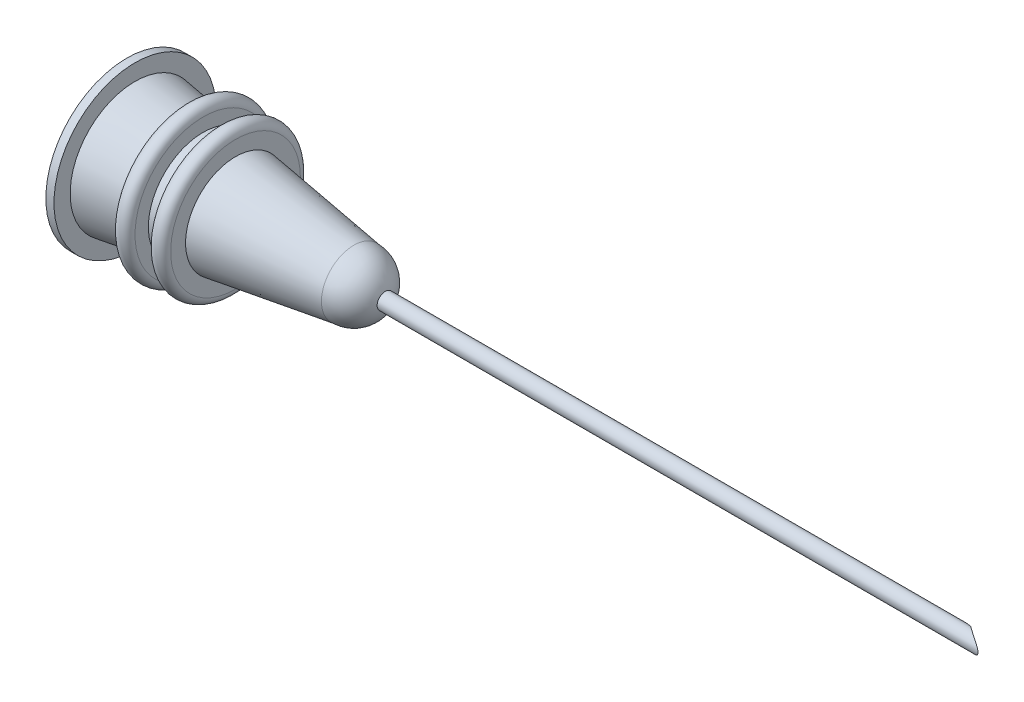
ISO-10303-21;
HEADER;
FILE_DESCRIPTION(('STEP AP214'),'2;1');
FILE_NAME('part.step','',(''),(''),'','','');
FILE_SCHEMA(('AUTOMOTIVE_DESIGN { 1 0 10303 214 1 1 1 1 }'));
ENDSEC;
DATA;
#1=APPLICATION_CONTEXT('core data for automotive mechanical design processes');
#2=APPLICATION_PROTOCOL_DEFINITION('international standard','automotive_design',2000,#1);
#3=PRODUCT_CONTEXT('',#1,'mechanical');
#4=PRODUCT('Part','Part','',(#3));
#5=PRODUCT_RELATED_PRODUCT_CATEGORY('part','',(#4));
#6=PRODUCT_DEFINITION_FORMATION('','',#4);
#7=PRODUCT_DEFINITION_CONTEXT('part definition',#1,'design');
#8=PRODUCT_DEFINITION('design','',#6,#7);
#9=PRODUCT_DEFINITION_SHAPE('','',#8);
#10=(LENGTH_UNIT() NAMED_UNIT(*) SI_UNIT(.MILLI.,.METRE.));
#11=(NAMED_UNIT(*) PLANE_ANGLE_UNIT() SI_UNIT($,.RADIAN.));
#12=(NAMED_UNIT(*) SI_UNIT($,.STERADIAN.) SOLID_ANGLE_UNIT());
#13=UNCERTAINTY_MEASURE_WITH_UNIT(LENGTH_MEASURE(1.E-05),#10,'distance_accuracy_value','');
#14=(GEOMETRIC_REPRESENTATION_CONTEXT(3) GLOBAL_UNCERTAINTY_ASSIGNED_CONTEXT((#13)) GLOBAL_UNIT_ASSIGNED_CONTEXT((#10,
#11,#12)) REPRESENTATION_CONTEXT('',''));
#15=CARTESIAN_POINT('',(0.,0.,0.));
#16=DIRECTION('',(0.,0.,1.));
#17=DIRECTION('',(1.,0.,0.));
#18=AXIS2_PLACEMENT_3D('',#15,#16,#17);
#19=CARTESIAN_POINT('',(0.,0.,0.));
#20=DIRECTION('',(0.,0.,1.));
#21=DIRECTION('',(1.,0.,0.));
#22=AXIS2_PLACEMENT_3D('',#19,#20,#21);
#23=SPHERICAL_SURFACE('',#22,2.);
#24=CARTESIAN_POINT('',(0.,0.,0.));
#25=DIRECTION('',(-1.,0.,0.));
#26=DIRECTION('',(0.,0.,1.));
#27=AXIS2_PLACEMENT_3D('',#24,#25,#26);
#28=SPHERICAL_SURFACE('',#27,2.);
#29=CARTESIAN_POINT('',(1.93649167310371,0.,0.));
#30=DIRECTION('',(-1.,0.,0.));
#31=DIRECTION('',(0.,0.,1.));
#32=AXIS2_PLACEMENT_3D('',#29,#30,#31);
#33=CIRCLE('',#32,0.5);
#34=CARTESIAN_POINT('',(1.93649167310371,0.,0.5));
#35=VERTEX_POINT('',#34);
#36=EDGE_CURVE('E85',#35,#35,#33,.F.);
#37=ORIENTED_EDGE('',*,*,#36,.F.);
#38=EDGE_LOOP('',(#37));
#39=FACE_BOUND('',#38,.T.);
#40=CARTESIAN_POINT('',(0.,0.,0.));
#41=DIRECTION('',(1.,0.,0.));
#42=DIRECTION('',(0.,0.,-1.));
#43=AXIS2_PLACEMENT_3D('',#40,#41,#42);
#44=CIRCLE('',#43,2.);
#45=CARTESIAN_POINT('',(0.,0.,-2.));
#46=VERTEX_POINT('',#45);
#47=EDGE_CURVE('E74',#46,#46,#44,.T.);
#48=ORIENTED_EDGE('',*,*,#47,.T.);
#49=EDGE_LOOP('',(#48));
#50=FACE_BOUND('',#49,.T.);
#51=ADVANCED_FACE('F39',(#39,#50),#28,.T.);
#52=CARTESIAN_POINT('',(0.,0.,0.));
#53=DIRECTION('',(-1.,0.,0.));
#54=DIRECTION('',(0.,0.,1.));
#55=AXIS2_PLACEMENT_3D('',#52,#53,#54);
#56=CONICAL_SURFACE('',#55,2.,0.147078355388402);
#57=CARTESIAN_POINT('',(-7.3,0.,0.));
#58=DIRECTION('',(1.,0.,0.));
#59=DIRECTION('',(0.,0.,-1.));
#60=AXIS2_PLACEMENT_3D('',#57,#58,#59);
#61=CIRCLE('',#60,3.08148148148148);
#62=CARTESIAN_POINT('',(-7.3,0.,-3.08148148148148));
#63=VERTEX_POINT('',#62);
#64=EDGE_CURVE('E76',#63,#63,#61,.T.);
#65=ORIENTED_EDGE('',*,*,#64,.T.);
#66=EDGE_LOOP('',(#65));
#67=FACE_BOUND('',#66,.T.);
#68=ORIENTED_EDGE('',*,*,#47,.F.);
#69=EDGE_LOOP('',(#68));
#70=FACE_BOUND('',#69,.T.);
#71=ADVANCED_FACE('F162',(#67,#70),#56,.T.);
#72=CARTESIAN_POINT('',(-7.3,4.,0.));
#73=DIRECTION('',(1.,0.,0.));
#74=DIRECTION('',(0.,0.,-1.));
#75=AXIS2_PLACEMENT_3D('',#72,#73,#74);
#76=PLANE('',#75);
#77=CARTESIAN_POINT('',(-7.3,0.,0.));
#78=DIRECTION('',(1.,0.,0.));
#79=DIRECTION('',(0.,0.,-1.));
#80=AXIS2_PLACEMENT_3D('',#77,#78,#79);
#81=CIRCLE('',#80,4.);
#82=CARTESIAN_POINT('',(-7.3,0.,-4.));
#83=VERTEX_POINT('',#82);
#84=EDGE_CURVE('E176',#83,#83,#81,.T.);
#85=ORIENTED_EDGE('',*,*,#84,.T.);
#86=EDGE_LOOP('',(#85));
#87=FACE_BOUND('',#86,.T.);
#88=ORIENTED_EDGE('',*,*,#64,.F.);
#89=EDGE_LOOP('',(#88));
#90=FACE_BOUND('',#89,.T.);
#91=ADVANCED_FACE('F159',(#87,#90),#76,.T.);
#92=CARTESIAN_POINT('',(-7.8,0.,0.));
#93=DIRECTION('',(1.,0.,0.));
#94=DIRECTION('',(0.,0.,-1.));
#95=AXIS2_PLACEMENT_3D('',#92,#93,#94);
#96=TOROIDAL_SURFACE('',#95,4.,0.5);
#97=CARTESIAN_POINT('',(-8.3,0.,0.));
#98=DIRECTION('',(1.,0.,0.));
#99=DIRECTION('',(0.,0.,-1.));
#100=AXIS2_PLACEMENT_3D('',#97,#98,#99);
#101=CIRCLE('',#100,4.);
#102=CARTESIAN_POINT('',(-8.3,0.,-4.));
#103=VERTEX_POINT('',#102);
#104=EDGE_CURVE('E179',#103,#103,#101,.T.);
#105=ORIENTED_EDGE('',*,*,#104,.T.);
#106=EDGE_LOOP('',(#105));
#107=FACE_BOUND('',#106,.T.);
#108=ORIENTED_EDGE('',*,*,#84,.F.);
#109=EDGE_LOOP('',(#108));
#110=FACE_BOUND('',#109,.T.);
#111=ADVANCED_FACE('F155',(#107,#110),#96,.T.);
#112=CARTESIAN_POINT('',(-8.3,4.,0.));
#113=DIRECTION('',(-1.,0.,0.));
#114=DIRECTION('',(0.,0.,1.));
#115=AXIS2_PLACEMENT_3D('',#112,#113,#114);
#116=PLANE('',#115);
#117=CARTESIAN_POINT('',(-8.3,0.,0.));
#118=DIRECTION('',(1.,0.,0.));
#119=DIRECTION('',(0.,0.,-1.));
#120=AXIS2_PLACEMENT_3D('',#117,#118,#119);
#121=CIRCLE('',#120,3.22962962962963);
#122=CARTESIAN_POINT('',(-8.3,0.,-3.22962962962963));
#123=VERTEX_POINT('',#122);
#124=EDGE_CURVE('E184',#123,#123,#121,.T.);
#125=ORIENTED_EDGE('',*,*,#124,.T.);
#126=EDGE_LOOP('',(#125));
#127=FACE_BOUND('',#126,.T.);
#128=ORIENTED_EDGE('',*,*,#104,.F.);
#129=EDGE_LOOP('',(#128));
#130=FACE_BOUND('',#129,.T.);
#131=ADVANCED_FACE('F151',(#127,#130),#116,.T.);
#132=CARTESIAN_POINT('',(-8.3,0.,0.));
#133=DIRECTION('',(-1.,0.,0.));
#134=DIRECTION('',(0.,0.,1.));
#135=AXIS2_PLACEMENT_3D('',#132,#133,#134);
#136=CONICAL_SURFACE('',#135,3.22962962962963,0.147078355388402);
#137=CARTESIAN_POINT('',(-9.3,0.,0.));
#138=DIRECTION('',(1.,0.,0.));
#139=DIRECTION('',(0.,0.,-1.));
#140=AXIS2_PLACEMENT_3D('',#137,#138,#139);
#141=CIRCLE('',#140,3.37777777777778);
#142=CARTESIAN_POINT('',(-9.3,0.,-3.37777777777778));
#143=VERTEX_POINT('',#142);
#144=EDGE_CURVE('E187',#143,#143,#141,.T.);
#145=ORIENTED_EDGE('',*,*,#144,.T.);
#146=EDGE_LOOP('',(#145));
#147=FACE_BOUND('',#146,.T.);
#148=ORIENTED_EDGE('',*,*,#124,.F.);
#149=EDGE_LOOP('',(#148));
#150=FACE_BOUND('',#149,.T.);
#151=ADVANCED_FACE('F147',(#147,#150),#136,.T.);
#152=CARTESIAN_POINT('',(-9.3,4.2,0.));
#153=DIRECTION('',(1.,0.,0.));
#154=DIRECTION('',(0.,0.,-1.));
#155=AXIS2_PLACEMENT_3D('',#152,#153,#154);
#156=PLANE('',#155);
#157=CARTESIAN_POINT('',(-9.3,0.,0.));
#158=DIRECTION('',(1.,0.,0.));
#159=DIRECTION('',(0.,0.,-1.));
#160=AXIS2_PLACEMENT_3D('',#157,#158,#159);
#161=CIRCLE('',#160,4.2);
#162=CARTESIAN_POINT('',(-9.3,0.,-4.2));
#163=VERTEX_POINT('',#162);
#164=EDGE_CURVE('E190',#163,#163,#161,.T.);
#165=ORIENTED_EDGE('',*,*,#164,.T.);
#166=EDGE_LOOP('',(#165));
#167=FACE_BOUND('',#166,.T.);
#168=ORIENTED_EDGE('',*,*,#144,.F.);
#169=EDGE_LOOP('',(#168));
#170=FACE_BOUND('',#169,.T.);
#171=ADVANCED_FACE('F143',(#167,#170),#156,.T.);
#172=CARTESIAN_POINT('',(-9.8,0.,0.));
#173=DIRECTION('',(1.,0.,0.));
#174=DIRECTION('',(0.,0.,-1.));
#175=AXIS2_PLACEMENT_3D('',#172,#173,#174);
#176=TOROIDAL_SURFACE('',#175,4.2,0.5);
#177=CARTESIAN_POINT('',(-10.3,0.,0.));
#178=DIRECTION('',(1.,0.,0.));
#179=DIRECTION('',(0.,0.,-1.));
#180=AXIS2_PLACEMENT_3D('',#177,#178,#179);
#181=CIRCLE('',#180,4.2);
#182=CARTESIAN_POINT('',(-10.3,0.,-4.2));
#183=VERTEX_POINT('',#182);
#184=EDGE_CURVE('E193',#183,#183,#181,.T.);
#185=ORIENTED_EDGE('',*,*,#184,.T.);
#186=EDGE_LOOP('',(#185));
#187=FACE_BOUND('',#186,.T.);
#188=ORIENTED_EDGE('',*,*,#164,.F.);
#189=EDGE_LOOP('',(#188));
#190=FACE_BOUND('',#189,.T.);
#191=ADVANCED_FACE('F139',(#187,#190),#176,.T.);
#192=CARTESIAN_POINT('',(-10.3,4.2,0.));
#193=DIRECTION('',(-1.,0.,0.));
#194=DIRECTION('',(0.,0.,1.));
#195=AXIS2_PLACEMENT_3D('',#192,#193,#194);
#196=PLANE('',#195);
#197=CARTESIAN_POINT('',(-10.3,0.,0.));
#198=DIRECTION('',(1.,0.,0.));
#199=DIRECTION('',(0.,0.,-1.));
#200=AXIS2_PLACEMENT_3D('',#197,#198,#199);
#201=CIRCLE('',#200,3.52592592592592);
#202=CARTESIAN_POINT('',(-10.3,0.,-3.52592592592592));
#203=VERTEX_POINT('',#202);
#204=EDGE_CURVE('E196',#203,#203,#201,.T.);
#205=ORIENTED_EDGE('',*,*,#204,.T.);
#206=EDGE_LOOP('',(#205));
#207=FACE_BOUND('',#206,.T.);
#208=ORIENTED_EDGE('',*,*,#184,.F.);
#209=EDGE_LOOP('',(#208));
#210=FACE_BOUND('',#209,.T.);
#211=ADVANCED_FACE('F135',(#207,#210),#196,.T.);
#212=CARTESIAN_POINT('',(-10.3,0.,0.));
#213=DIRECTION('',(-1.,0.,0.));
#214=DIRECTION('',(0.,0.,1.));
#215=AXIS2_PLACEMENT_3D('',#212,#213,#214);
#216=CONICAL_SURFACE('',#215,3.52592592592592,0.147078355388402);
#217=CARTESIAN_POINT('',(-13.5,0.,0.));
#218=DIRECTION('',(1.,0.,0.));
#219=DIRECTION('',(0.,0.,-1.));
#220=AXIS2_PLACEMENT_3D('',#217,#218,#219);
#221=CIRCLE('',#220,4.);
#222=CARTESIAN_POINT('',(-13.5,0.,-4.));
#223=VERTEX_POINT('',#222);
#224=EDGE_CURVE('E199',#223,#223,#221,.T.);
#225=ORIENTED_EDGE('',*,*,#224,.T.);
#226=EDGE_LOOP('',(#225));
#227=FACE_BOUND('',#226,.T.);
#228=ORIENTED_EDGE('',*,*,#204,.F.);
#229=EDGE_LOOP('',(#228));
#230=FACE_BOUND('',#229,.T.);
#231=ADVANCED_FACE('F131',(#227,#230),#216,.T.);
#232=CARTESIAN_POINT('',(-13.5,4.,0.));
#233=DIRECTION('',(1.,0.,0.));
#234=DIRECTION('',(0.,0.,-1.));
#235=AXIS2_PLACEMENT_3D('',#232,#233,#234);
#236=PLANE('',#235);
#237=CARTESIAN_POINT('',(-13.5,0.,0.));
#238=DIRECTION('',(1.,0.,0.));
#239=DIRECTION('',(0.,0.,-1.));
#240=AXIS2_PLACEMENT_3D('',#237,#238,#239);
#241=CIRCLE('',#240,5.);
#242=CARTESIAN_POINT('',(-13.5,0.,-5.));
#243=VERTEX_POINT('',#242);
#244=EDGE_CURVE('E202',#243,#243,#241,.T.);
#245=ORIENTED_EDGE('',*,*,#244,.T.);
#246=EDGE_LOOP('',(#245));
#247=FACE_BOUND('',#246,.T.);
#248=ORIENTED_EDGE('',*,*,#224,.F.);
#249=EDGE_LOOP('',(#248));
#250=FACE_BOUND('',#249,.T.);
#251=ADVANCED_FACE('F127',(#247,#250),#236,.T.);
#252=CARTESIAN_POINT('',(0.,0.,0.));
#253=DIRECTION('',(1.,0.,0.));
#254=DIRECTION('',(0.,0.,-1.));
#255=AXIS2_PLACEMENT_3D('',#252,#253,#254);
#256=CYLINDRICAL_SURFACE('',#255,5.);
#257=CARTESIAN_POINT('',(-14.,0.,0.));
#258=DIRECTION('',(1.,0.,0.));
#259=DIRECTION('',(0.,0.,-1.));
#260=AXIS2_PLACEMENT_3D('',#257,#258,#259);
#261=CIRCLE('',#260,5.);
#262=CARTESIAN_POINT('',(-14.,0.,-5.));
#263=VERTEX_POINT('',#262);
#264=EDGE_CURVE('E205',#263,#263,#261,.T.);
#265=ORIENTED_EDGE('',*,*,#264,.T.);
#266=EDGE_LOOP('',(#265));
#267=FACE_BOUND('',#266,.T.);
#268=ORIENTED_EDGE('',*,*,#244,.F.);
#269=EDGE_LOOP('',(#268));
#270=FACE_BOUND('',#269,.T.);
#271=ADVANCED_FACE('F123',(#267,#270),#256,.T.);
#272=CARTESIAN_POINT('',(-14.,5.,0.));
#273=DIRECTION('',(-1.,0.,0.));
#274=DIRECTION('',(0.,0.,1.));
#275=AXIS2_PLACEMENT_3D('',#272,#273,#274);
#276=PLANE('',#275);
#277=CARTESIAN_POINT('',(-14.,0.,0.));
#278=DIRECTION('',(1.,0.,0.));
#279=DIRECTION('',(0.,0.,-1.));
#280=AXIS2_PLACEMENT_3D('',#277,#278,#279);
#281=CIRCLE('',#280,3.31588829274317);
#282=CARTESIAN_POINT('',(-14.,0.,-3.31588829274317));
#283=VERTEX_POINT('',#282);
#284=EDGE_CURVE('E208',#283,#283,#281,.T.);
#285=ORIENTED_EDGE('',*,*,#284,.T.);
#286=EDGE_LOOP('',(#285));
#287=FACE_BOUND('',#286,.T.);
#288=ORIENTED_EDGE('',*,*,#264,.F.);
#289=EDGE_LOOP('',(#288));
#290=FACE_BOUND('',#289,.T.);
#291=ADVANCED_FACE('F119',(#287,#290),#276,.T.);
#292=CARTESIAN_POINT('',(-14.,0.,0.));
#293=DIRECTION('',(-1.,0.,0.));
#294=DIRECTION('',(0.,0.,1.));
#295=AXIS2_PLACEMENT_3D('',#292,#293,#294);
#296=CONICAL_SURFACE('',#295,3.31588829274317,0.147078355388402);
#297=CARTESIAN_POINT('',(-1.,0.,0.));
#298=DIRECTION('',(1.,0.,0.));
#299=DIRECTION('',(0.,0.,-1.));
#300=AXIS2_PLACEMENT_3D('',#297,#298,#299);
#301=CIRCLE('',#300,1.38996236681725);
#302=CARTESIAN_POINT('',(-1.,0.,-1.38996236681725));
#303=VERTEX_POINT('',#302);
#304=EDGE_CURVE('E210',#303,#303,#301,.T.);
#305=ORIENTED_EDGE('',*,*,#304,.T.);
#306=EDGE_LOOP('',(#305));
#307=FACE_BOUND('',#306,.T.);
#308=ORIENTED_EDGE('',*,*,#284,.F.);
#309=EDGE_LOOP('',(#308));
#310=FACE_BOUND('',#309,.T.);
#311=ADVANCED_FACE('F115',(#307,#310),#296,.F.);
#312=CARTESIAN_POINT('',(-1.,1.38996236681725,0.));
#313=DIRECTION('',(-1.,0.,0.));
#314=DIRECTION('',(0.,0.,1.));
#315=AXIS2_PLACEMENT_3D('',#312,#313,#314);
#316=PLANE('',#315);
#317=ORIENTED_EDGE('',*,*,#304,.F.);
#318=EDGE_LOOP('',(#317));
#319=FACE_BOUND('',#318,.T.);
#320=CARTESIAN_POINT('',(-1.,0.,0.));
#321=DIRECTION('',(-1.,0.,0.));
#322=DIRECTION('',(0.,0.,1.));
#323=AXIS2_PLACEMENT_3D('',#320,#321,#322);
#324=CIRCLE('',#323,0.375);
#325=CARTESIAN_POINT('',(-1.,0.,0.375));
#326=VERTEX_POINT('',#325);
#327=EDGE_CURVE('E101',#326,#326,#324,.T.);
#328=ORIENTED_EDGE('',*,*,#327,.F.);
#329=EDGE_LOOP('',(#328));
#330=FACE_BOUND('',#329,.T.);
#331=ADVANCED_FACE('F110',(#319,#330),#316,.T.);
#332=CARTESIAN_POINT('',(39.,0.,0.));
#333=DIRECTION('',(-1.,0.,0.));
#334=DIRECTION('',(0.,0.,1.));
#335=AXIS2_PLACEMENT_3D('',#332,#333,#334);
#336=CYLINDRICAL_SURFACE('',#335,0.5);
#337=CARTESIAN_POINT('',(39.,-0.5,0.));
#338=CARTESIAN_POINT('',(38.9583904464747,-0.499994803298946,-7.99673521089671E-08));
#339=CARTESIAN_POINT('',(38.9167847254722,-0.500000699921479,-0.000742115513358594));
#340=CARTESIAN_POINT('',(38.8336253744731,-0.499989394064269,-0.00370895092813826));
#341=CARTESIAN_POINT('',(38.7920717455169,-0.499972191130249,-0.00593377995719229));
#342=CARTESIAN_POINT('',(38.6674118848881,-0.499817818955422,-0.0148411402855794));
#343=CARTESIAN_POINT('',(38.5844535810992,-0.499577585148702,-0.0237565455544003));
#344=CARTESIAN_POINT('',(38.4169432825375,-0.497856255421235,-0.0478382860272766));
#345=CARTESIAN_POINT('',(38.3324174936529,-0.496338385050073,-0.0631830287886607));
#346=CARTESIAN_POINT('',(38.1648805450954,-0.490255252748027,-0.100013123175821));
#347=CARTESIAN_POINT('',(38.0818676852382,-0.485693659984474,-0.121491063501163));
#348=CARTESIAN_POINT('',(37.9596030795196,-0.474562469753925,-0.157941447869739));
#349=CARTESIAN_POINT('',(37.9194849914223,-0.470180555173614,-0.170698035666228));
#350=CARTESIAN_POINT('',(37.8399333663788,-0.459536871384369,-0.197575650367584));
#351=CARTESIAN_POINT('',(37.8005000872512,-0.45327440974508,-0.21169717855188));
#352=CARTESIAN_POINT('',(37.722915270225,-0.438364892673408,-0.241049302382515));
#353=CARTESIAN_POINT('',(37.6847553892127,-0.429739812563383,-0.256268768910112));
#354=CARTESIAN_POINT('',(37.6097252192644,-0.409356892287562,-0.287713508448095));
#355=CARTESIAN_POINT('',(37.5728534926489,-0.39760267962269,-0.303937600222462));
#356=CARTESIAN_POINT('',(37.5128661440604,-0.374549876832646,-0.331540481008057));
#357=CARTESIAN_POINT('',(37.4892365292266,-0.364387986342912,-0.342745772960855));
#358=CARTESIAN_POINT('',(37.4430556379542,-0.341816851227132,-0.365261804181128));
#359=CARTESIAN_POINT('',(37.4205059784337,-0.329404362252174,-0.376572673019891));
#360=CARTESIAN_POINT('',(37.3768046784772,-0.301783420635364,-0.399057398946937));
#361=CARTESIAN_POINT('',(37.3556647263046,-0.286554794683712,-0.410229603733906));
#362=CARTESIAN_POINT('',(37.3157151122843,-0.252837038529341,-0.431825297276893));
#363=CARTESIAN_POINT('',(37.2969006298143,-0.234354852566207,-0.442250315403696));
#364=CARTESIAN_POINT('',(37.2687262244161,-0.200780968946557,-0.458149245183976));
#365=CARTESIAN_POINT('',(37.2583587285163,-0.186758291166878,-0.464081033678554));
#366=CARTESIAN_POINT('',(37.239560520521,-0.157093393318153,-0.474942938073182));
#367=CARTESIAN_POINT('',(37.2311291954037,-0.141451688140049,-0.479873370960625));
#368=CARTESIAN_POINT('',(37.2166666265028,-0.108480043032767,-0.488390104026612));
#369=CARTESIAN_POINT('',(37.2106663897658,-0.0911315991674563,-0.491959007160743));
#370=CARTESIAN_POINT('',(37.2018019565138,-0.0553843135358398,-0.497249310117112));
#371=CARTESIAN_POINT('',(37.1989322410427,-0.0369873806716421,-0.498973961159396));
#372=CARTESIAN_POINT('',(37.1968218353719,-0.00270346847246074,-0.500241795186489));
#373=CARTESIAN_POINT('',(37.1971000086102,0.0131445987378425,-0.500074206118567));
#374=CARTESIAN_POINT('',(37.2001189825966,0.0445176814328982,-0.498261940402623));
#375=CARTESIAN_POINT('',(37.2028601919027,0.0600426428850769,-0.496617018700896));
#376=CARTESIAN_POINT('',(37.2103117895527,0.0892841279112462,-0.492171377414631));
#377=CARTESIAN_POINT('',(37.2148766121181,0.10305196613142,-0.48945626107802));
#378=CARTESIAN_POINT('',(37.2256655709193,0.129678971269589,-0.48308490046222));
#379=CARTESIAN_POINT('',(37.2318901059111,0.142537918880694,-0.479428430024365));
#380=CARTESIAN_POINT('',(37.2496322634132,0.174246374316899,-0.469097838659774));
#381=CARTESIAN_POINT('',(37.262150493485,0.192361180484079,-0.461887875517415));
#382=CARTESIAN_POINT('',(37.28960869251,0.226105466199443,-0.446344293853159));
#383=CARTESIAN_POINT('',(37.3045554639449,0.241727713000594,-0.438007530460692));
#384=CARTESIAN_POINT('',(37.3462442427515,0.27994699460307,-0.415206129522202));
#385=CARTESIAN_POINT('',(37.3744316882328,0.300642256121808,-0.400222814352508));
#386=CARTESIAN_POINT('',(37.4335560090162,0.337223128487307,-0.369925059956415));
#387=CARTESIAN_POINT('',(37.4644987112064,0.353098217328216,-0.35460997341866));
#388=CARTESIAN_POINT('',(37.5275346471119,0.380827680333681,-0.32461972810918));
#389=CARTESIAN_POINT('',(37.5595933290358,0.392754926319961,-0.309937908317914));
#390=CARTESIAN_POINT('',(37.6249231613908,0.413789230212495,-0.281235941951396));
#391=CARTESIAN_POINT('',(37.658195466676,0.422893519250126,-0.267216456369516));
#392=CARTESIAN_POINT('',(37.7594754308689,0.446930135802758,-0.226410289778932));
#393=CARTESIAN_POINT('',(37.828801570503,0.458530024018995,-0.200945266527625));
#394=CARTESIAN_POINT('',(37.975398446559,0.476978485461339,-0.15236343615748));
#395=CARTESIAN_POINT('',(38.0528461316098,0.483343881777793,-0.129625755155971));
#396=CARTESIAN_POINT('',(38.2093982866884,0.492351913364939,-0.0895036853086109));
#397=CARTESIAN_POINT('',(38.2885045391685,0.494990310631255,-0.0721254082060827));
#398=CARTESIAN_POINT('',(38.4476853774396,0.498371474445396,-0.04290661281898));
#399=CARTESIAN_POINT('',(38.5277590577391,0.499115893607073,-0.0310612740754833));
#400=CARTESIAN_POINT('',(38.688486186485,0.499914979986723,-0.0129536418559289));
#401=CARTESIAN_POINT('',(38.769139156733,0.499970162457228,-0.0066871810345249));
#402=CARTESIAN_POINT('',(38.8749130413675,0.499995660635806,-0.00214622440247774));
#403=CARTESIAN_POINT('',(38.8999422888125,0.499998263581664,-0.00134085138135894));
#404=CARTESIAN_POINT('',(38.9499804378618,0.500000442140695,-0.000268132540508739));
#405=CARTESIAN_POINT('',(38.9749893248101,0.500000021603135,-1.03172216817782E-07));
#406=CARTESIAN_POINT('',(39.,0.5,0.));
#407=B_SPLINE_CURVE_WITH_KNOTS('',3,(#337,#338,#339,#340,#341,#342,#343,#344,#345,#346,#347,
#348,#349,#350,#351,#352,#353,#354,#355,#356,#357,#358,#359,#360,#361,#362,#363,#364,#365,#366,
#367,#368,#369,#370,#371,#372,#373,#374,#375,#376,#377,#378,#379,#380,#381,#382,#383,#384,#385,
#386,#387,#388,#389,#390,#391,#392,#393,#394,#395,#396,#397,#398,#399,#400,#401,#402,#403,#404,
#405,#406),.UNSPECIFIED.,.F.,.F.,(4,2,2,2,2,2,2,2,2,2,2,2,2,2,2,2,2,2,2,2,2,2,2,2,2,2,2,2,2,2,2,
2,2,2,4),(0.,0.124814384042121,0.249631222728082,0.499704596565306,0.7572322154963,
1.01444994778906,1.14137187366669,1.26834059049328,1.39416624727194,1.51984666892834,
1.60393189119591,1.68813930435156,1.77297510464742,1.85763198366321,1.91273336331845,
1.96781727289549,2.02358315965481,2.0792505741994,2.12654068640839,2.17383864435079,
2.21794082486962,2.26205361076341,2.33116467754335,2.40047277570449,2.51396061966746,
2.62769444530125,2.73919358516789,2.85080174439054,3.07452291406224,3.3171106682169,
3.55997404966028,3.80262544488738,4.045095430394,4.12021806659986,4.19524507938975),.UNSPECIFIED.);
#408=CARTESIAN_POINT('',(37.8614010421319,-0.462337439792473,-0.190378811232082));
#409=VERTEX_POINT('',#408);
#410=CARTESIAN_POINT('',(37.8614010421319,0.462337439792474,-0.190378811232083));
#411=VERTEX_POINT('',#410);
#412=EDGE_CURVE('E94',#409,#411,#407,.T.);
#413=ORIENTED_EDGE('',*,*,#412,.F.);
#414=CARTESIAN_POINT('',(39.,0.,0.5));
#415=CARTESIAN_POINT('',(39.0000005124618,-0.0125909528909834,0.500000207355728));
#416=CARTESIAN_POINT('',(38.9988973767319,-0.025180397369269,0.499519234809843));
#417=CARTESIAN_POINT('',(38.9946350092743,-0.0499385012717411,0.497655349963925));
#418=CARTESIAN_POINT('',(38.9914732444924,-0.0621066228241086,0.496271326494273));
#419=CARTESIAN_POINT('',(38.9823563092796,-0.0889280195617155,0.492262479074227));
#420=CARTESIAN_POINT('',(38.9758772393713,-0.103364580234846,0.48940345588389));
#421=CARTESIAN_POINT('',(38.9609393218666,-0.13093507860832,0.482760971508321));
#422=CARTESIAN_POINT('',(38.9524758727961,-0.144065886120112,0.478975360797057));
#423=CARTESIAN_POINT('',(38.9275153352082,-0.178239045217895,0.467710472161099));
#424=CARTESIAN_POINT('',(38.9096659117157,-0.198054079829813,0.459553038460227));
#425=CARTESIAN_POINT('',(38.8717810342524,-0.234766055902741,0.441927259547519));
#426=CARTESIAN_POINT('',(38.851739327943,-0.251654276504805,0.432455143089352));
#427=CARTESIAN_POINT('',(38.8092878959211,-0.283945989411704,0.412017024766675));
#428=CARTESIAN_POINT('',(38.7868090098062,-0.299223979781191,0.400998548477213));
#429=CARTESIAN_POINT('',(38.7409833987655,-0.327694695149542,0.378086153442413));
#430=CARTESIAN_POINT('',(38.7176358116827,-0.34088527638571,0.366191352847969));
#431=CARTESIAN_POINT('',(38.6467011525839,-0.377846909625647,0.329319170444028));
#432=CARTESIAN_POINT('',(38.5983064931673,-0.398948572353165,0.303194218455586));
#433=CARTESIAN_POINT('',(38.5116434295749,-0.43115045563295,0.25447255382657));
#434=CARTESIAN_POINT('',(38.4735100250777,-0.443430906903333,0.232378654642423));
#435=CARTESIAN_POINT('',(38.3971104600884,-0.464506651404059,0.186726812587654));
#436=CARTESIAN_POINT('',(38.3588442312142,-0.473299749030292,0.163167958156983));
#437=CARTESIAN_POINT('',(38.282573326214,-0.487302082271066,0.114760315750183));
#438=CARTESIAN_POINT('',(38.2445682950705,-0.492517980778311,0.0899140191581733));
#439=CARTESIAN_POINT('',(38.1690259956952,-0.499133481519282,0.0390331707596711));
#440=CARTESIAN_POINT('',(38.1314886539613,-0.500533691153066,0.0129988087461952));
#441=CARTESIAN_POINT('',(38.0482455780525,-0.498927562939486,-0.046445257302097));
#442=CARTESIAN_POINT('',(38.0027441156513,-0.494781695664623,-0.0801241456553621));
#443=CARTESIAN_POINT('',(37.9137717109363,-0.478773825724017,-0.148326395128305));
#444=CARTESIAN_POINT('',(37.8702974622003,-0.466924894940706,-0.182848230447304));
#445=CARTESIAN_POINT('',(37.7990873753449,-0.438752162381983,-0.241272096008405));
#446=CARTESIAN_POINT('',(37.7705107135906,-0.424801054172238,-0.265284381245067));
#447=CARTESIAN_POINT('',(37.7157304162491,-0.391519319774967,-0.312315004782395));
#448=CARTESIAN_POINT('',(37.6895233727716,-0.372196587332175,-0.33533474475003));
#449=CARTESIAN_POINT('',(37.6475525791964,-0.333831173526177,-0.372905362585786));
#450=CARTESIAN_POINT('',(37.6309360033177,-0.316265799889608,-0.388005428325767));
#451=CARTESIAN_POINT('',(37.600087878209,-0.277849988670347,-0.416374105719039));
#452=CARTESIAN_POINT('',(37.5858529458001,-0.257004294023518,-0.429645310499885));
#453=CARTESIAN_POINT('',(37.5630874986448,-0.21666810339116,-0.4510709905684));
#454=CARTESIAN_POINT('',(37.5539856241199,-0.197764164466051,-0.4597171666662));
#455=CARTESIAN_POINT('',(37.5381924423697,-0.158140254410441,-0.474805195656867));
#456=CARTESIAN_POINT('',(37.5314998568906,-0.13742125354202,-0.481248217347275));
#457=CARTESIAN_POINT('',(37.520893337094,-0.0944708469397574,-0.491493306016106));
#458=CARTESIAN_POINT('',(37.5170001579987,-0.0722294566734652,-0.495275641878065));
#459=CARTESIAN_POINT('',(37.5123694610005,-0.0271168805342251,-0.499777274653022));
#460=CARTESIAN_POINT('',(37.5116300022618,-0.00424609072665259,-0.500498455434737));
#461=CARTESIAN_POINT('',(37.5132539771268,0.0385080169191387,-0.498918024966597));
#462=CARTESIAN_POINT('',(37.5152553379314,0.0584201718955551,-0.496969128003496));
#463=CARTESIAN_POINT('',(37.5216131970898,0.0974963358523556,-0.490801109770033));
#464=CARTESIAN_POINT('',(37.5259697582255,0.116660324874539,-0.486581927981493));
#465=CARTESIAN_POINT('',(37.5368657837836,0.154020331730885,-0.476087301402336));
#466=CARTESIAN_POINT('',(37.5434308295209,0.172201964800404,-0.469787776017919));
#467=CARTESIAN_POINT('',(37.5584250557673,0.207060888106526,-0.455501199935989));
#468=CARTESIAN_POINT('',(37.5668550894069,0.223737484939516,-0.447513377009064));
#469=CARTESIAN_POINT('',(37.589714841899,0.263080275449752,-0.42603326608648));
#470=CARTESIAN_POINT('',(37.6050799191378,0.284768630916899,-0.411741513891854));
#471=CARTESIAN_POINT('',(37.6383818306927,0.324503752948605,-0.381219503320736));
#472=CARTESIAN_POINT('',(37.6563246044694,0.342541870930251,-0.364984782841594));
#473=CARTESIAN_POINT('',(37.7025210143635,0.382444080092323,-0.323858118593175));
#474=CARTESIAN_POINT('',(37.7318113331719,0.402441902171908,-0.298327089514046));
#475=CARTESIAN_POINT('',(37.7929800658604,0.436205873847514,-0.246347043710285));
#476=CARTESIAN_POINT('',(37.8248621657757,0.449962958336858,-0.219896751308745));
#477=CARTESIAN_POINT('',(37.9078283958452,0.478091109284276,-0.152866087287852));
#478=CARTESIAN_POINT('',(37.9600964867726,0.488887498694186,-0.112262309511031));
#479=CARTESIAN_POINT('',(38.0670020784229,0.500558963882678,-0.0326366728156283));
#480=CARTESIAN_POINT('',(38.1216472997683,0.501398843337304,0.00637908857633488));
#481=CARTESIAN_POINT('',(38.2144319440119,0.495765744064802,0.0698560734920381));
#482=CARTESIAN_POINT('',(38.2522738905908,0.491540865370263,0.0949887438968994));
#483=CARTESIAN_POINT('',(38.3282187737208,0.479490713597583,0.143962449973586));
#484=CARTESIAN_POINT('',(38.36632169173,0.471665693745094,0.167803576357838));
#485=CARTESIAN_POINT('',(38.4423634200552,0.452582378861434,0.21398891750308));
#486=CARTESIAN_POINT('',(38.480302304127,0.441337233440525,0.236338472559681));
#487=CARTESIAN_POINT('',(38.5558126738647,0.415339597052174,0.279515004247105));
#488=CARTESIAN_POINT('',(38.593384455557,0.400590225866142,0.300343313786823));
#489=CARTESIAN_POINT('',(38.6559590907704,0.372489684595171,0.334018864297576));
#490=CARTESIAN_POINT('',(38.6811861567437,0.360166517670902,0.347310237810937));
#491=CARTESIAN_POINT('',(38.7311002530146,0.33340045808994,0.373081913110669));
#492=CARTESIAN_POINT('',(38.7557846268843,0.318949032528365,0.385558643647925));
#493=CARTESIAN_POINT('',(38.8111139461936,0.283029235472358,0.412976311430089));
#494=CARTESIAN_POINT('',(38.841400607675,0.260743111463108,0.427576356855478));
#495=CARTESIAN_POINT('',(38.8982701147684,0.210646212952149,0.454348852429626));
#496=CARTESIAN_POINT('',(38.9248834069582,0.182886151744351,0.466541670631288));
#497=CARTESIAN_POINT('',(38.9550180833392,0.140092279107698,0.480113210586274));
#498=CARTESIAN_POINT('',(38.962358149907,0.128406724746649,0.483392844161234));
#499=CARTESIAN_POINT('',(38.975475938997,0.104007762155108,0.489223989864512));
#500=CARTESIAN_POINT('',(38.9812549401945,0.0912952063029823,0.491776098007413));
#501=CARTESIAN_POINT('',(38.9904546486923,0.0656917407073116,0.495824904565758));
#502=CARTESIAN_POINT('',(38.9939902333964,0.0528515671350377,0.497373123463732));
#503=CARTESIAN_POINT('',(38.9987608387592,0.026673156762745,0.499459771770725));
#504=CARTESIAN_POINT('',(38.9999994572251,0.0133357323105379,0.499999780378776));
#505=CARTESIAN_POINT('',(39.,0.,0.5));
#506=B_SPLINE_CURVE_WITH_KNOTS('',3,(#414,#415,#416,#417,#418,#419,#420,#421,#422,#423,#424,
#425,#426,#427,#428,#429,#430,#431,#432,#433,#434,#435,#436,#437,#438,#439,#440,#441,#442,#443,
#444,#445,#446,#447,#448,#449,#450,#451,#452,#453,#454,#455,#456,#457,#458,#459,#460,#461,#462,
#463,#464,#465,#466,#467,#468,#469,#470,#471,#472,#473,#474,#475,#476,#477,#478,#479,#480,#481,
#482,#483,#484,#485,#486,#487,#488,#489,#490,#491,#492,#493,#494,#495,#496,#497,#498,#499,#500,
#501,#502,#503,#504,#505),.UNSPECIFIED.,.T.,.F.,(4,2,2,2,2,2,2,2,2,2,2,2,2,2,2,2,2,2,2,2,2,2,2,
2,2,2,2,2,2,2,2,2,2,2,2,2,2,2,2,2,2,2,2,2,2,4),(0.,0.0377171393239235,0.0754807758880128,
0.123446598823008,0.171524766870326,0.254722773433654,0.33816457033518,0.426012773857266,
0.513950619770759,0.690155197571436,0.827274241281504,0.964479477289659,1.10142845559558,
1.23835563241803,1.40818053954058,1.57771800818296,1.69692531488621,1.81595836096603,
1.90120441387978,1.98632832532865,2.05414059542094,2.12191683434377,2.1901905356779,
2.25842221452333,2.31845737033666,2.37849412656512,2.43925172309345,2.50003717059807,
2.590063563213,2.68030082221581,2.81067025081278,2.94122844844337,3.14131553751746,
3.34210972563429,3.47882789418195,3.61553644775786,3.75172589353518,3.88779454241786,
3.98091668391423,4.07442289530074,4.19516734257764,4.31484167914277,4.35728560279303,
4.39969465428997,4.43970555935149,4.47965374102591),.UNSPECIFIED.);
#507=EDGE_CURVE('E53',#411,#409,#506,.T.);
#508=ORIENTED_EDGE('',*,*,#507,.F.);
#509=EDGE_LOOP('',(#413,#508));
#510=FACE_BOUND('',#509,.T.);
#511=ORIENTED_EDGE('',*,*,#36,.T.);
#512=EDGE_LOOP('',(#511));
#513=FACE_BOUND('',#512,.T.);
#514=ADVANCED_FACE('F106',(#510,#513),#336,.T.);
#515=CARTESIAN_POINT('',(39.,0.,0.));
#516=DIRECTION('',(-1.,0.,0.));
#517=DIRECTION('',(0.,0.,1.));
#518=AXIS2_PLACEMENT_3D('',#515,#516,#517);
#519=CYLINDRICAL_SURFACE('',#518,0.375);
#520=CARTESIAN_POINT('',(39.,-0.375,0.));
#521=CARTESIAN_POINT('',(38.9687172882148,-0.374997730410719,1.55684874962942E-08));
#522=CARTESIAN_POINT('',(38.9374360239019,-0.375000271117309,-0.000419420066799191));
#523=CARTESIAN_POINT('',(38.874896182891,-0.374995508331238,-0.00209668931991857));
#524=CARTESIAN_POINT('',(38.8436376060489,-0.374988204901666,-0.0033545175646256));
#525=CARTESIAN_POINT('',(38.7498906909202,-0.374922307720044,-0.00838668396821064));
#526=CARTESIAN_POINT('',(38.6874655632978,-0.374819686800748,-0.0134197032169252));
#527=CARTESIAN_POINT('',(38.5621598569765,-0.374094934786773,-0.0269151720440407));
#528=CARTESIAN_POINT('',(38.4992840658622,-0.373465997701552,-0.0354217984014894));
#529=CARTESIAN_POINT('',(38.3741390689933,-0.37096224739,-0.0558283461192825));
#530=CARTESIAN_POINT('',(38.3118696256459,-0.369087943871211,-0.0677268780926012));
#531=CARTESIAN_POINT('',(38.1762176334091,-0.362494425679048,-0.0974896777727217));
#532=CARTESIAN_POINT('',(38.1030038738212,-0.357296922874498,-0.116061498129649));
#533=CARTESIAN_POINT('',(37.9948402994412,-0.345062996580087,-0.147231486687494));
#534=CARTESIAN_POINT('',(37.9591485808886,-0.340262792015744,-0.158142346836338));
#535=CARTESIAN_POINT('',(37.88842924391,-0.3286805707061,-0.1809959384025));
#536=CARTESIAN_POINT('',(37.8534012720156,-0.321899642261831,-0.192938100643651));
#537=CARTESIAN_POINT('',(37.7895569449259,-0.306922076587049,-0.215826417103353));
#538=CARTESIAN_POINT('',(37.7606088701963,-0.299099759685882,-0.226646181046268));
#539=CARTESIAN_POINT('',(37.7035658377778,-0.280930804525562,-0.24881628104574));
#540=CARTESIAN_POINT('',(37.6754742867236,-0.270575272616139,-0.260168369953243));
#541=CARTESIAN_POINT('',(37.6204415537864,-0.246374628288589,-0.283212620373679));
#542=CARTESIAN_POINT('',(37.5935207909359,-0.232484682520518,-0.294907299719374));
#543=CARTESIAN_POINT('',(37.5424530670269,-0.200037013049557,-0.317812018894777));
#544=CARTESIAN_POINT('',(37.51828752964,-0.181513618479551,-0.329024941946787));
#545=CARTESIAN_POINT('',(37.4885879956568,-0.151517482910573,-0.343147006404318));
#546=CARTESIAN_POINT('',(37.4807544780891,-0.142741315727479,-0.346912633235461));
#547=CARTESIAN_POINT('',(37.466149732505,-0.124153987343389,-0.353991709482665));
#548=CARTESIAN_POINT('',(37.4593790714284,-0.114342278407451,-0.357304917451599));
#549=CARTESIAN_POINT('',(37.4471951459178,-0.0935488790342711,-0.363306820800264));
#550=CARTESIAN_POINT('',(37.4417987135049,-0.0825548282731155,-0.365987744886852));
#551=CARTESIAN_POINT('',(37.4329361618969,-0.059638412334715,-0.37040962556153));
#552=CARTESIAN_POINT('',(37.4294655795611,-0.0477182671459714,-0.372152755191556));
#553=CARTESIAN_POINT('',(37.4253740356653,-0.0260973761516807,-0.374210979880057));
#554=CARTESIAN_POINT('',(37.4242850488299,-0.0165070523213118,-0.374760415558573));
#555=CARTESIAN_POINT('',(37.4235854115202,0.00274091909756395,-0.375113236269557));
#556=CARTESIAN_POINT('',(37.4239742495065,0.0123985422356583,-0.374916879453221));
#557=CARTESIAN_POINT('',(37.4261937789791,0.0314783082212574,-0.373798568410039));
#558=CARTESIAN_POINT('',(37.428021390673,0.0409009097521775,-0.37287816405897));
#559=CARTESIAN_POINT('',(37.4329672810218,0.0593103331309121,-0.370396823510798));
#560=CARTESIAN_POINT('',(37.4360864724416,0.0682968417622303,-0.368835434333638));
#561=CARTESIAN_POINT('',(37.4449114074443,0.0892445034188109,-0.364440674928589));
#562=CARTESIAN_POINT('',(37.4511532203266,0.100924509260633,-0.361348251077625));
#563=CARTESIAN_POINT('',(37.4652435708934,0.123029962748584,-0.354434116411919));
#564=CARTESIAN_POINT('',(37.4730959500643,0.133452314470491,-0.35061066346976));
#565=CARTESIAN_POINT('',(37.4951173527453,0.159104809731508,-0.340007413987128));
#566=CARTESIAN_POINT('',(37.5102119435455,0.173375725748724,-0.332849945783249));
#567=CARTESIAN_POINT('',(37.5422188328781,0.199327373741432,-0.317989819474891));
#568=CARTESIAN_POINT('',(37.559135304399,0.211001963192133,-0.310285924171889));
#569=CARTESIAN_POINT('',(37.5938841908295,0.232111885433185,-0.294817510471759));
#570=CARTESIAN_POINT('',(37.6116998598329,0.241577108443962,-0.287055472301038));
#571=CARTESIAN_POINT('',(37.6481270772305,0.258872913332522,-0.271558683850836));
#572=CARTESIAN_POINT('',(37.6667394025819,0.266701853510916,-0.263823968558982));
#573=CARTESIAN_POINT('',(37.7234954657028,0.288221979360731,-0.24082864324064));
#574=CARTESIAN_POINT('',(37.7624935990456,0.299910687571343,-0.225805889345194));
#575=CARTESIAN_POINT('',(37.83118094678,0.316972656081181,-0.200784097303949));
#576=CARTESIAN_POINT('',(37.8605791959771,0.323198839807134,-0.190513723536472));
#577=CARTESIAN_POINT('',(37.9199016852071,0.334097393476874,-0.170681046524729));
#578=CARTESIAN_POINT('',(37.9498259738199,0.338769619110518,-0.16111880910644));
#579=CARTESIAN_POINT('',(38.0402935031756,0.350991988007618,-0.133556780948031));
#580=CARTESIAN_POINT('',(38.1014339254747,0.356726278640363,-0.116717300381971));
#581=CARTESIAN_POINT('',(38.2249074268228,0.365271479261498,-0.0863078711490842));
#582=CARTESIAN_POINT('',(38.2872438492933,0.368072401868076,-0.0727492125355483));
#583=CARTESIAN_POINT('',(38.4126242104237,0.37197161306024,-0.0490492101461538));
#584=CARTESIAN_POINT('',(38.4756683266721,0.373069464201682,-0.03890874487714));
#585=CARTESIAN_POINT('',(38.6156596681307,0.374591842040001,-0.020306125418459));
#586=CARTESIAN_POINT('',(38.69271856714,0.374824075379576,-0.012656611684314));
#587=CARTESIAN_POINT('',(38.8082254524175,0.37497294324757,-0.00504702906506723));
#588=CARTESIAN_POINT('',(38.8465564041058,0.374989654310609,-0.00315458038644311));
#589=CARTESIAN_POINT('',(38.9232571271157,0.375000791274415,-0.000631144046244783));
#590=CARTESIAN_POINT('',(38.9616268955279,0.374995218737221,-6.79694455800187E-08));
#591=CARTESIAN_POINT('',(39.,0.375,0.));
#592=B_SPLINE_CURVE_WITH_KNOTS('',3,(#520,#521,#522,#523,#524,#525,#526,#527,#528,#529,#530,
#531,#532,#533,#534,#535,#536,#537,#538,#539,#540,#541,#542,#543,#544,#545,#546,#547,#548,#549,
#550,#551,#552,#553,#554,#555,#556,#557,#558,#559,#560,#561,#562,#563,#564,#565,#566,#567,#568,
#569,#570,#571,#572,#573,#574,#575,#576,#577,#578,#579,#580,#581,#582,#583,#584,#585,#586,#587,
#588,#589,#590,#591),.UNSPECIFIED.,.F.,.F.,(4,2,2,2,2,2,2,2,2,2,2,2,2,2,2,2,2,2,2,2,2,2,2,2,2,2,
2,2,2,2,2,2,2,2,2,4),(0.,0.0938424300048386,0.187684258594165,0.375470966145748,
0.565724226446171,0.755899667211298,0.982692603819968,1.09552981825861,1.20830515097414,
1.30385876135459,1.39975278269644,1.49692976621253,1.59340705394758,1.63038731742254,
1.66738724004743,1.70482063886853,1.74216691989577,1.77103568317809,1.7998944546376,
1.82869161936295,1.85750916999757,1.89807681842138,1.93874237724189,2.00428485338188,
2.06998078161052,2.13472841758396,2.19954070694481,2.32940135326468,2.42463087791828,
2.51986924370586,2.71066252189617,2.90210331210604,3.09359326689663,3.32571385132303,
3.44082937461408,3.55593682866226),.UNSPECIFIED.);
#593=CARTESIAN_POINT('',(37.8614010421319,-0.323080343310854,-0.190378811232083));
#594=VERTEX_POINT('',#593);
#595=CARTESIAN_POINT('',(37.8614010421319,0.323080343310854,-0.190378811232082));
#596=VERTEX_POINT('',#595);
#597=EDGE_CURVE('E67',#594,#596,#592,.T.);
#598=ORIENTED_EDGE('',*,*,#597,.T.);
#599=CARTESIAN_POINT('',(38.7350454919052,0.,0.375));
#600=CARTESIAN_POINT('',(38.7350459797431,-0.0104463020832966,0.37500023325839));
#601=CARTESIAN_POINT('',(38.7341773169946,-0.020891046994244,0.374559178034385));
#602=CARTESIAN_POINT('',(38.7308102181923,-0.0414445042891864,0.37284585251797));
#603=CARTESIAN_POINT('',(38.7283101536048,-0.0515528702772255,0.371572751640718));
#604=CARTESIAN_POINT('',(38.721118763504,-0.0737022798421546,0.367898449640773));
#605=CARTESIAN_POINT('',(38.7160310901554,-0.0855783562843358,0.365292291608305));
#606=CARTESIAN_POINT('',(38.7042533903639,-0.108264318288726,0.35922480282825));
#607=CARTESIAN_POINT('',(38.6975599195805,-0.119071840523181,0.355761633331653));
#608=CARTESIAN_POINT('',(38.6783744215533,-0.146269502159729,0.345768568602607));
#609=CARTESIAN_POINT('',(38.6649231489633,-0.161775528324493,0.338699510120284));
#610=CARTESIAN_POINT('',(38.6362812530341,-0.190434798108679,0.323454461902736));
#611=CARTESIAN_POINT('',(38.6210859593206,-0.203581470582228,0.315275488694585));
#612=CARTESIAN_POINT('',(38.5748839307757,-0.239433912199879,0.290067151232061));
#613=CARTESIAN_POINT('',(38.5424435544019,-0.259505800759805,0.271946665578348));
#614=CARTESIAN_POINT('',(38.475938820445,-0.294369501356471,0.233743077635488));
#615=CARTESIAN_POINT('',(38.4418698505664,-0.309145170345771,0.213654208654618));
#616=CARTESIAN_POINT('',(38.3807618276376,-0.331349556849097,0.17659850725403));
#617=CARTESIAN_POINT('',(38.3538600746945,-0.339682831733584,0.159942142736195));
#618=CARTESIAN_POINT('',(38.2998964731845,-0.353749747077397,0.125804701074143));
#619=CARTESIAN_POINT('',(38.2728345380479,-0.359481820734957,0.108323133858703));
#620=CARTESIAN_POINT('',(38.1917736248762,-0.372792849400623,0.054817797754027));
#621=CARTESIAN_POINT('',(38.1377911624703,-0.37652501155841,0.017667952777924));
#622=CARTESIAN_POINT('',(38.0487894731307,-0.373034837662784,-0.0461995681883597));
#623=CARTESIAN_POINT('',(38.0132656045674,-0.368955264430714,-0.0724207995639597));
#624=CARTESIAN_POINT('',(37.9437285199066,-0.354549621503537,-0.125166341055216));
#625=CARTESIAN_POINT('',(37.9097122395803,-0.344236910876066,-0.151689884297051));
#626=CARTESIAN_POINT('',(37.8554862046427,-0.320872482317491,-0.195057166021044));
#627=CARTESIAN_POINT('',(37.8345276839092,-0.309957900220345,-0.212114121476911));
#628=CARTESIAN_POINT('',(37.7942834876795,-0.284346305855523,-0.245381792950506));
#629=CARTESIAN_POINT('',(37.7749956595363,-0.26965426067526,-0.26159358687666));
#630=CARTESIAN_POINT('',(37.7439381285855,-0.240661475196403,-0.288059013891121));
#631=CARTESIAN_POINT('',(37.7315664964733,-0.227381251870278,-0.298718517082917));
#632=CARTESIAN_POINT('',(37.7086096038869,-0.198447679427655,-0.31867092576517));
#633=CARTESIAN_POINT('',(37.6980216493419,-0.182797978316065,-0.327965889478717));
#634=CARTESIAN_POINT('',(37.6813048757603,-0.152863344195089,-0.342741573260997));
#635=CARTESIAN_POINT('',(37.674707471376,-0.139034700107739,-0.348611595754411));
#636=CARTESIAN_POINT('',(37.6633060978698,-0.110111749171779,-0.358796382356536));
#637=CARTESIAN_POINT('',(37.6585010232419,-0.0950182295561795,-0.363112105097798));
#638=CARTESIAN_POINT('',(37.6509773629165,-0.063775890536545,-0.369884782531349));
#639=CARTESIAN_POINT('',(37.6482753188251,-0.0476197677008263,-0.372326998852355));
#640=CARTESIAN_POINT('',(37.6452501343136,-0.0149079329454357,-0.37506198115789));
#641=CARTESIAN_POINT('',(37.6449254962327,0.00164752081652836,-0.375356100348382));
#642=CARTESIAN_POINT('',(37.6465688193256,0.0324786357994958,-0.373869746187427));
#643=CARTESIAN_POINT('',(37.6482581911924,0.046783011886743,-0.372341365290585));
#644=CARTESIAN_POINT('',(37.6533641707326,0.074817826763518,-0.367735141605144));
#645=CARTESIAN_POINT('',(37.6567809645577,0.0885482035246596,-0.364657131824554));
#646=CARTESIAN_POINT('',(37.6652396072229,0.115443427655798,-0.357068248895094));
#647=CARTESIAN_POINT('',(37.6703169841415,0.128588037663034,-0.352526083961869));
#648=CARTESIAN_POINT('',(37.6818217953025,0.153783260028747,-0.342287884355283));
#649=CARTESIAN_POINT('',(37.6882498751893,0.165833345237961,-0.33659129790779));
#650=CARTESIAN_POINT('',(37.7060531687937,0.195056371198141,-0.320911170306176));
#651=CARTESIAN_POINT('',(37.7182080030366,0.211413979587178,-0.310290046775516));
#652=CARTESIAN_POINT('',(37.744448422237,0.241359012195424,-0.2876201682513));
#653=CARTESIAN_POINT('',(37.7585388606816,0.254939252168587,-0.275567835166306));
#654=CARTESIAN_POINT('',(37.7953247763957,0.285533229257899,-0.244492924094275));
#655=CARTESIAN_POINT('',(37.8188635019466,0.300987587911876,-0.224939483203417));
#656=CARTESIAN_POINT('',(37.8678507819497,0.327027274580348,-0.185057265797749));
#657=CARTESIAN_POINT('',(37.893302590814,0.33760407675477,-0.164727198402294));
#658=CARTESIAN_POINT('',(37.9595542911913,0.359220520413938,-0.11290611183322));
#659=CARTESIAN_POINT('',(38.0012091082194,0.367415715982432,-0.0813264655979445));
#660=CARTESIAN_POINT('',(38.086029903448,0.375825778181099,-0.019132890964233));
#661=CARTESIAN_POINT('',(38.1291993040106,0.376021227455499,0.0114785075073927));
#662=CARTESIAN_POINT('',(38.2181459531158,0.369268055684819,0.0724609864345359));
#663=CARTESIAN_POINT('',(38.2639505284367,0.361983821452809,0.102753407923703));
#664=CARTESIAN_POINT('',(38.355157048326,0.340118638915543,0.160973942850484));
#665=CARTESIAN_POINT('',(38.4005598221827,0.32556180663097,0.188909516106596));
#666=CARTESIAN_POINT('',(38.4678226913456,0.297491883012436,0.228895264467496));
#667=CARTESIAN_POINT('',(38.4903099651712,0.286967202812385,0.242017824308834));
#668=CARTESIAN_POINT('',(38.5346058476435,0.26346063461001,0.267422264131048));
#669=CARTESIAN_POINT('',(38.5564121535766,0.250471280879104,0.279701431345175));
#670=CARTESIAN_POINT('',(38.5989748879811,0.221375727279289,0.303274144335854));
#671=CARTESIAN_POINT('',(38.6197128799908,0.205229331129733,0.314551914273475));
#672=CARTESIAN_POINT('',(38.6585545363621,0.169099203648,0.335354356603691));
#673=CARTESIAN_POINT('',(38.6766758197246,0.149143463007117,0.344890880706279));
#674=CARTESIAN_POINT('',(38.6985354467674,0.117456283345037,0.356266087753538));
#675=CARTESIAN_POINT('',(38.7044953241036,0.107722828309085,0.359348972329217));
#676=CARTESIAN_POINT('',(38.7151291318675,0.0873864216447883,0.364828064407717));
#677=CARTESIAN_POINT('',(38.7198040424289,0.076784140789139,0.367224795346107));
#678=CARTESIAN_POINT('',(38.7272801610243,0.0553292869326754,0.371047748581705));
#679=CARTESIAN_POINT('',(38.7301589294665,0.044511744676683,0.372514198579534));
#680=CARTESIAN_POINT('',(38.7340399913865,0.0224617906818061,0.374489514426975));
#681=CARTESIAN_POINT('',(38.7350449674691,0.0112299955518708,0.3749997492423));
#682=CARTESIAN_POINT('',(38.7350454919052,0.,0.375));
#683=B_SPLINE_CURVE_WITH_KNOTS('',3,(#599,#600,#601,#602,#603,#604,#605,#606,#607,#608,#609,
#610,#611,#612,#613,#614,#615,#616,#617,#618,#619,#620,#621,#622,#623,#624,#625,#626,#627,#628,
#629,#630,#631,#632,#633,#634,#635,#636,#637,#638,#639,#640,#641,#642,#643,#644,#645,#646,#647,
#648,#649,#650,#651,#652,#653,#654,#655,#656,#657,#658,#659,#660,#661,#662,#663,#664,#665,#666,
#667,#668,#669,#670,#671,#672,#673,#674,#675,#676,#677,#678,#679,#680,#681,#682),.UNSPECIFIED.,
.T.,.F.,(4,2,2,2,2,2,2,2,2,2,2,2,2,2,2,2,2,2,2,2,2,2,2,2,2,2,2,2,2,2,2,2,2,2,2,2,2,2,2,2,2,4),
(0.,0.0312937622530542,0.0626188111388118,0.101936638583554,0.141339566562011,0.206104032763346,
0.271046169022271,0.39704690094156,0.523428485219222,0.621461395723984,0.719553277031148,
0.915344445568038,1.04803635888848,1.18044488595918,1.26764844497669,1.35473791896245,
1.41768560352526,1.4805373423365,1.52957203580318,1.57857643454742,1.62796249289244,
1.67731743752447,1.72056801678328,1.76382325783366,1.80807217007692,1.8523422818868,
1.92089413104654,1.98962112159596,2.09189298791848,2.19434295140755,2.35221100179531,
2.51046221418152,2.67613820068506,2.8412684142304,2.92542553876683,3.00984177472685,
3.09541247888704,3.18037706892536,3.21575079050986,3.2510974547355,3.28478717949847,
3.31842863540324),.UNSPECIFIED.);
#684=EDGE_CURVE('E62',#596,#594,#683,.T.);
#685=ORIENTED_EDGE('',*,*,#684,.T.);
#686=EDGE_LOOP('',(#598,#685));
#687=FACE_BOUND('',#686,.T.);
#688=ORIENTED_EDGE('',*,*,#327,.T.);
#689=EDGE_LOOP('',(#688));
#690=FACE_BOUND('',#689,.T.);
#691=ADVANCED_FACE('F70',(#687,#690),#519,.F.);
#692=CARTESIAN_POINT('',(39.,-5.,-3.5));
#693=DIRECTION('',(0.,1.,0.));
#694=DIRECTION('',(0.,0.,1.));
#695=AXIS2_PLACEMENT_3D('',#692,#693,#694);
#696=CYLINDRICAL_SURFACE('',#695,3.5);
#697=ORIENTED_EDGE('',*,*,#412,.T.);
#698=DIRECTION('',(0.,1.,0.));
#699=VECTOR('',#698,1.);
#700=CARTESIAN_POINT('',(37.8614010421319,0.,-0.190378811232083));
#701=LINE('',#700,#699);
#702=EDGE_CURVE('E12',#411,#596,#701,.F.);
#703=ORIENTED_EDGE('',*,*,#702,.T.);
#704=ORIENTED_EDGE('',*,*,#597,.F.);
#705=EDGE_CURVE('E42',#594,#409,#701,.F.);
#706=ORIENTED_EDGE('',*,*,#705,.T.);
#707=EDGE_LOOP('',(#697,#703,#704,#706));
#708=FACE_BOUND('',#707,.T.);
#709=ADVANCED_FACE('F73',(#708),#696,.F.);
#710=CARTESIAN_POINT('',(41.,-5.,-4.08257569495584));
#711=DIRECTION('',(0.,1.,0.));
#712=DIRECTION('',(0.,0.,1.));
#713=AXIS2_PLACEMENT_3D('',#710,#711,#712);
#714=CYLINDRICAL_SURFACE('',#713,5.);
#715=ORIENTED_EDGE('',*,*,#507,.T.);
#716=ORIENTED_EDGE('',*,*,#705,.F.);
#717=ORIENTED_EDGE('',*,*,#684,.F.);
#718=ORIENTED_EDGE('',*,*,#702,.F.);
#719=EDGE_LOOP('',(#715,#716,#717,#718));
#720=FACE_BOUND('',#719,.T.);
#721=ADVANCED_FACE('F61',(#720),#714,.F.);
#722=CLOSED_SHELL('',(#51,#71,#91,#111,#131,#151,#171,#191,#211,#231,#251,#271,#291,#311,#331,
#514,#691,#709,#721));
#723=MANIFOLD_SOLID_BREP('B2',#722);
#724=ADVANCED_BREP_SHAPE_REPRESENTATION('',(#18,#723),#14);
#725=SHAPE_DEFINITION_REPRESENTATION(#9,#724);
ENDSEC;
END-ISO-10303-21;
